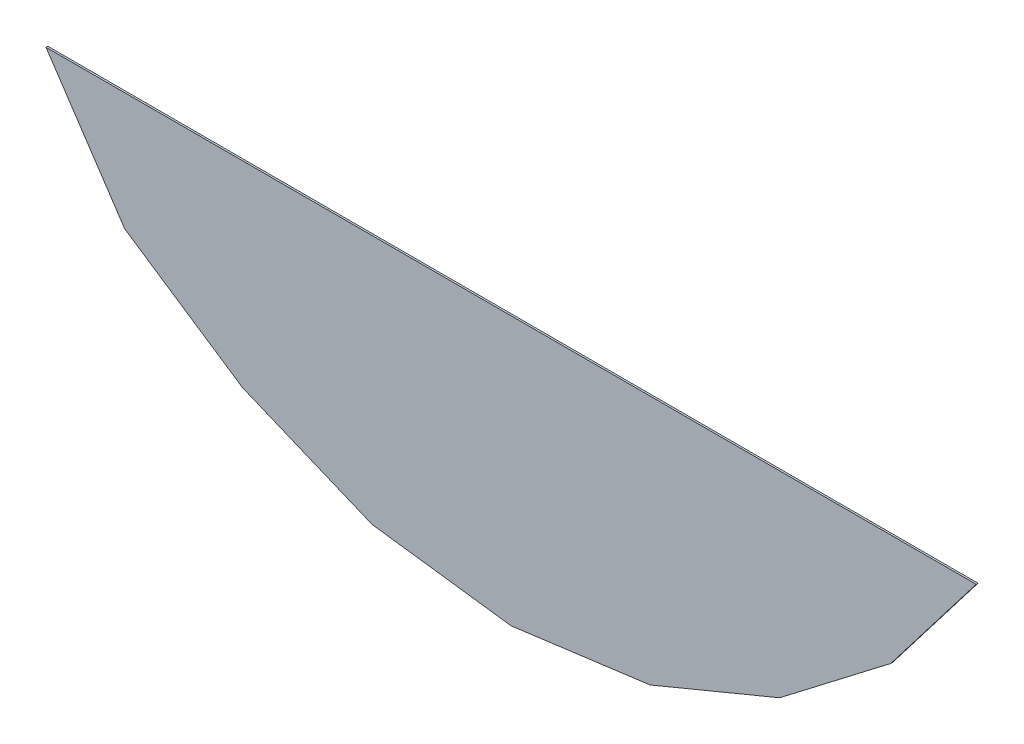
ISO-10303-21;
HEADER;
FILE_DESCRIPTION(('STEP AP214'),'2;1');
FILE_NAME('part.step','',(''),(''),'','','');
FILE_SCHEMA(('AUTOMOTIVE_DESIGN { 1 0 10303 214 1 1 1 1 }'));
ENDSEC;
DATA;
#1=APPLICATION_CONTEXT('core data for automotive mechanical design processes');
#2=APPLICATION_PROTOCOL_DEFINITION('international standard','automotive_design',2000,#1);
#3=PRODUCT_CONTEXT('',#1,'mechanical');
#4=PRODUCT('Part','Part','',(#3));
#5=PRODUCT_RELATED_PRODUCT_CATEGORY('part','',(#4));
#6=PRODUCT_DEFINITION_FORMATION('','',#4);
#7=PRODUCT_DEFINITION_CONTEXT('part definition',#1,'design');
#8=PRODUCT_DEFINITION('design','',#6,#7);
#9=PRODUCT_DEFINITION_SHAPE('','',#8);
#10=(LENGTH_UNIT() NAMED_UNIT(*) SI_UNIT(.MILLI.,.METRE.));
#11=(NAMED_UNIT(*) PLANE_ANGLE_UNIT() SI_UNIT($,.RADIAN.));
#12=(NAMED_UNIT(*) SI_UNIT($,.STERADIAN.) SOLID_ANGLE_UNIT());
#13=UNCERTAINTY_MEASURE_WITH_UNIT(LENGTH_MEASURE(1.E-05),#10,'distance_accuracy_value','');
#14=(GEOMETRIC_REPRESENTATION_CONTEXT(3) GLOBAL_UNCERTAINTY_ASSIGNED_CONTEXT((#13)) GLOBAL_UNIT_ASSIGNED_CONTEXT((#10,
#11,#12)) REPRESENTATION_CONTEXT('',''));
#15=CARTESIAN_POINT('',(0.,0.,0.));
#16=DIRECTION('',(0.,0.,1.));
#17=DIRECTION('',(1.,0.,0.));
#18=AXIS2_PLACEMENT_3D('',#15,#16,#17);
#19=CARTESIAN_POINT('',(-2.55477772,-4.28920148,3.9099998));
#20=DIRECTION('',(0.,0.,1.));
#21=DIRECTION('',(1.,0.,0.));
#22=AXIS2_PLACEMENT_3D('',#19,#20,#21);
#23=PLANE('',#22);
#24=DIRECTION('',(0.923879753352727,0.382682899206254,0.));
#25=VECTOR('',#24,1.);
#26=CARTESIAN_POINT('',(0.763513839999964,-5.66368183999992,3.9099998));
#27=LINE('',#26,#25);
#28=CARTESIAN_POINT('',(0.763513839999941,-5.66368183999987,3.9099998));
#29=VERTEX_POINT('',#28);
#30=CARTESIAN_POINT('',(1.47499832000001,-5.36897580000002,3.9099998));
#31=VERTEX_POINT('',#30);
#32=EDGE_CURVE('E91',#29,#31,#27,.T.);
#33=ORIENTED_EDGE('',*,*,#32,.T.);
#34=DIRECTION('',(0.793354187267818,0.608760325205758,0.));
#35=VECTOR('',#34,1.);
#36=CARTESIAN_POINT('',(1.47499832000001,-5.36897580000001,3.9099998));
#37=LINE('',#36,#35);
#38=CARTESIAN_POINT('',(2.08596230000003,-4.90016800000002,3.9099998));
#39=VERTEX_POINT('',#38);
#40=EDGE_CURVE('E88',#31,#39,#37,.T.);
#41=ORIENTED_EDGE('',*,*,#40,.T.);
#42=DIRECTION('',(0.608760808228389,0.793353816632351,0.));
#43=VECTOR('',#42,1.);
#44=CARTESIAN_POINT('',(2.08596230000002,-4.90016800000001,3.9099998));
#45=LINE('',#44,#43);
#46=CARTESIAN_POINT('',(2.55477264,-4.28920148,3.9099998));
#47=VERTEX_POINT('',#46);
#48=EDGE_CURVE('E20',#39,#47,#45,.T.);
#49=ORIENTED_EDGE('',*,*,#48,.T.);
#50=DIRECTION('',(1.,0.,0.));
#51=VECTOR('',#50,1.);
#52=CARTESIAN_POINT('',(-2.55477772,-4.28920148,3.9099998));
#53=LINE('',#52,#51);
#54=CARTESIAN_POINT('',(-2.5547777200001,-4.28920148000002,3.9099998));
#55=VERTEX_POINT('',#54);
#56=EDGE_CURVE('E94',#55,#47,#53,.T.);
#57=ORIENTED_EDGE('',*,*,#56,.F.);
#58=DIRECTION('',(0.555139797690147,-0.831757058894328,0.));
#59=VECTOR('',#58,1.);
#60=CARTESIAN_POINT('',(-2.55477772000007,-4.28920148000005,3.9099998));
#61=LINE('',#60,#59);
#62=CARTESIAN_POINT('',(-2.12257131999997,-4.93676939999994,3.9099998));
#63=VERTEX_POINT('',#62);
#64=EDGE_CURVE('E84',#55,#63,#61,.T.);
#65=ORIENTED_EDGE('',*,*,#64,.T.);
#66=DIRECTION('',(0.831757058894323,-0.555139797690155,0.));
#67=VECTOR('',#66,1.);
#68=CARTESIAN_POINT('',(-2.12257131999998,-4.93676939999997,3.9099998));
#69=LINE('',#68,#67);
#70=CARTESIAN_POINT('',(-1.47500340000005,-5.36897580000013,3.9099998));
#71=VERTEX_POINT('',#70);
#72=EDGE_CURVE('E105',#63,#71,#69,.T.);
#73=ORIENTED_EDGE('',*,*,#72,.T.);
#74=DIRECTION('',(0.92387975335268,-0.382682899206369,0.));
#75=VECTOR('',#74,1.);
#76=CARTESIAN_POINT('',(-1.47500340000004,-5.36897580000008,3.9099998));
#77=LINE('',#76,#75);
#78=CARTESIAN_POINT('',(-0.763518920000012,-5.66368184000013,3.9099998));
#79=VERTEX_POINT('',#78);
#80=EDGE_CURVE('E106',#71,#79,#77,.T.);
#81=ORIENTED_EDGE('',*,*,#80,.T.);
#82=DIRECTION('',(0.991445008976792,-0.130525071059199,0.));
#83=VECTOR('',#82,1.);
#84=CARTESIAN_POINT('',(-0.763518920000012,-5.66368184000008,3.9099998));
#85=LINE('',#84,#83);
#86=CARTESIAN_POINT('',(-2.54000002067E-06,-5.76419979999987,3.9099998));
#87=VERTEX_POINT('',#86);
#88=EDGE_CURVE('E110',#79,#87,#85,.T.);
#89=ORIENTED_EDGE('',*,*,#88,.T.);
#90=DIRECTION('',(0.991445008976763,0.130525071059419,0.));
#91=VECTOR('',#90,1.);
#92=CARTESIAN_POINT('',(-2.54000000806526E-06,-5.76419979999992,3.9099998));
#93=LINE('',#92,#91);
#94=EDGE_CURVE('E112',#87,#29,#93,.T.);
#95=ORIENTED_EDGE('',*,*,#94,.T.);
#96=EDGE_LOOP('',(#33,#41,#49,#57,#65,#73,#81,#89,#95));
#97=FACE_BOUND('',#96,.T.);
#98=ADVANCED_FACE('F17',(#97),#23,.T.);
#99=CARTESIAN_POINT('',(-2.55477772,-4.28920148,3.89999982));
#100=DIRECTION('',(0.,1.,0.));
#101=DIRECTION('',(0.,0.,1.));
#102=AXIS2_PLACEMENT_3D('',#99,#100,#101);
#103=PLANE('',#102);
#104=DIRECTION('',(0.,0.,1.));
#105=VECTOR('',#104,1.);
#106=CARTESIAN_POINT('',(-2.55477772000014,-4.2892014800001,3.89999982));
#107=LINE('',#106,#105);
#108=CARTESIAN_POINT('',(-2.5547777200001,-4.28920148000002,3.89999982));
#109=VERTEX_POINT('',#108);
#110=EDGE_CURVE('E116',#55,#109,#107,.F.);
#111=ORIENTED_EDGE('',*,*,#110,.F.);
#112=ORIENTED_EDGE('',*,*,#56,.T.);
#113=DIRECTION('',(0.,0.,1.));
#114=VECTOR('',#113,1.);
#115=CARTESIAN_POINT('',(2.55477264,-4.28920148,3.89999982));
#116=LINE('',#115,#114);
#117=CARTESIAN_POINT('',(2.55477264,-4.28920148,3.89999982));
#118=VERTEX_POINT('',#117);
#119=EDGE_CURVE('E99',#118,#47,#116,.T.);
#120=ORIENTED_EDGE('',*,*,#119,.F.);
#121=DIRECTION('',(1.,0.,0.));
#122=VECTOR('',#121,1.);
#123=CARTESIAN_POINT('',(-2.55477772,-4.28920148,3.89999982));
#124=LINE('',#123,#122);
#125=EDGE_CURVE('E130',#118,#109,#124,.F.);
#126=ORIENTED_EDGE('',*,*,#125,.T.);
#127=EDGE_LOOP('',(#111,#112,#120,#126));
#128=FACE_BOUND('',#127,.T.);
#129=ADVANCED_FACE('F181',(#128),#103,.T.);
#130=CARTESIAN_POINT('',(-2.12257132,-4.9367694,3.89999982));
#131=DIRECTION('',(-0.831757058894295,-0.555139797690197,0.));
#132=DIRECTION('',(0.555139797690197,-0.831757058894295,0.));
#133=AXIS2_PLACEMENT_3D('',#130,#131,#132);
#134=PLANE('',#133);
#135=DIRECTION('',(0.,0.,1.));
#136=VECTOR('',#135,1.);
#137=CARTESIAN_POINT('',(-2.12257131999991,-4.93676939999986,3.89999982));
#138=LINE('',#137,#136);
#139=CARTESIAN_POINT('',(-2.12257131999998,-4.93676939999995,3.89999982));
#140=VERTEX_POINT('',#139);
#141=EDGE_CURVE('E118',#63,#140,#138,.F.);
#142=ORIENTED_EDGE('',*,*,#141,.F.);
#143=ORIENTED_EDGE('',*,*,#64,.F.);
#144=ORIENTED_EDGE('',*,*,#110,.T.);
#145=DIRECTION('',(0.555139797690147,-0.831757058894328,0.));
#146=VECTOR('',#145,1.);
#147=CARTESIAN_POINT('',(-2.55477772000007,-4.28920148000005,3.89999982));
#148=LINE('',#147,#146);
#149=EDGE_CURVE('E133',#109,#140,#148,.T.);
#150=ORIENTED_EDGE('',*,*,#149,.T.);
#151=EDGE_LOOP('',(#142,#143,#144,#150));
#152=FACE_BOUND('',#151,.T.);
#153=ADVANCED_FACE('F178',(#152),#134,.T.);
#154=CARTESIAN_POINT('',(-1.4750034,-5.3689758,3.89999982));
#155=DIRECTION('',(-0.555139797690197,-0.831757058894295,0.));
#156=DIRECTION('',(0.831757058894295,-0.555139797690197,0.));
#157=AXIS2_PLACEMENT_3D('',#154,#155,#156);
#158=PLANE('',#157);
#159=DIRECTION('',(0.,0.,1.));
#160=VECTOR('',#159,1.);
#161=CARTESIAN_POINT('',(-1.47500340000014,-5.36897580000034,3.89999982));
#162=LINE('',#161,#160);
#163=CARTESIAN_POINT('',(-1.47500340000004,-5.36897580000011,3.89999982));
#164=VERTEX_POINT('',#163);
#165=EDGE_CURVE('E120',#71,#164,#162,.F.);
#166=ORIENTED_EDGE('',*,*,#165,.F.);
#167=ORIENTED_EDGE('',*,*,#72,.F.);
#168=ORIENTED_EDGE('',*,*,#141,.T.);
#169=DIRECTION('',(0.831757058894323,-0.555139797690155,0.));
#170=VECTOR('',#169,1.);
#171=CARTESIAN_POINT('',(-2.12257131999998,-4.93676939999997,3.89999982));
#172=LINE('',#171,#170);
#173=EDGE_CURVE('E136',#140,#164,#172,.T.);
#174=ORIENTED_EDGE('',*,*,#173,.T.);
#175=EDGE_LOOP('',(#166,#167,#168,#174));
#176=FACE_BOUND('',#175,.T.);
#177=ADVANCED_FACE('F175',(#176),#158,.T.);
#178=CARTESIAN_POINT('',(-0.76351892,-5.66368184,3.89999982));
#179=DIRECTION('',(-0.382682899205941,-0.923879753352857,0.));
#180=DIRECTION('',(0.923879753352857,-0.382682899205941,0.));
#181=AXIS2_PLACEMENT_3D('',#178,#179,#180);
#182=PLANE('',#181);
#183=DIRECTION('',(0.,0.,1.));
#184=VECTOR('',#183,1.);
#185=CARTESIAN_POINT('',(-0.763518920000046,-5.66368184000034,3.89999982));
#186=LINE('',#185,#184);
#187=CARTESIAN_POINT('',(-0.763518920000005,-5.66368184000011,3.89999982));
#188=VERTEX_POINT('',#187);
#189=EDGE_CURVE('E122',#79,#188,#186,.F.);
#190=ORIENTED_EDGE('',*,*,#189,.F.);
#191=ORIENTED_EDGE('',*,*,#80,.F.);
#192=ORIENTED_EDGE('',*,*,#165,.T.);
#193=DIRECTION('',(0.92387975335268,-0.382682899206368,0.));
#194=VECTOR('',#193,1.);
#195=CARTESIAN_POINT('',(-1.47500340000004,-5.36897580000008,3.89999982));
#196=LINE('',#195,#194);
#197=EDGE_CURVE('E139',#164,#188,#196,.T.);
#198=ORIENTED_EDGE('',*,*,#197,.T.);
#199=EDGE_LOOP('',(#190,#191,#192,#198));
#200=FACE_BOUND('',#199,.T.);
#201=ADVANCED_FACE('F170',(#200),#182,.T.);
#202=CARTESIAN_POINT('',(-2.539999996998E-06,-5.7641998,3.89999982));
#203=DIRECTION('',(-0.130525071058976,-0.991445008976821,0.));
#204=DIRECTION('',(0.991445008976821,-0.130525071058976,0.));
#205=AXIS2_PLACEMENT_3D('',#202,#203,#204);
#206=PLANE('',#205);
#207=DIRECTION('',(0.,0.,1.));
#208=VECTOR('',#207,1.);
#209=CARTESIAN_POINT('',(-2.54000004167552E-06,-5.76419979999966,3.89999982));
#210=LINE('',#209,#208);
#211=CARTESIAN_POINT('',(-2.54000002262806E-06,-5.76419979999989,3.89999982));
#212=VERTEX_POINT('',#211);
#213=EDGE_CURVE('E124',#87,#212,#210,.F.);
#214=ORIENTED_EDGE('',*,*,#213,.F.);
#215=ORIENTED_EDGE('',*,*,#88,.F.);
#216=ORIENTED_EDGE('',*,*,#189,.T.);
#217=DIRECTION('',(0.991445008976792,-0.130525071059199,0.));
#218=VECTOR('',#217,1.);
#219=CARTESIAN_POINT('',(-0.763518920000012,-5.66368184000008,3.89999982));
#220=LINE('',#219,#218);
#221=EDGE_CURVE('E142',#188,#212,#220,.T.);
#222=ORIENTED_EDGE('',*,*,#221,.T.);
#223=EDGE_LOOP('',(#214,#215,#216,#222));
#224=FACE_BOUND('',#223,.T.);
#225=ADVANCED_FACE('F165',(#224),#206,.T.);
#226=CARTESIAN_POINT('',(0.76351384,-5.66368184,3.89999982));
#227=DIRECTION('',(0.130525071058976,-0.991445008976821,0.));
#228=DIRECTION('',(0.991445008976821,0.130525071058976,0.));
#229=AXIS2_PLACEMENT_3D('',#226,#227,#228);
#230=PLANE('',#229);
#231=DIRECTION('',(0.,0.,1.));
#232=VECTOR('',#231,1.);
#233=CARTESIAN_POINT('',(0.763513839999859,-5.66368183999966,3.89999982));
#234=LINE('',#233,#232);
#235=CARTESIAN_POINT('',(0.763513839999943,-5.6636818399999,3.89999982));
#236=VERTEX_POINT('',#235);
#237=EDGE_CURVE('E126',#29,#236,#234,.F.);
#238=ORIENTED_EDGE('',*,*,#237,.F.);
#239=ORIENTED_EDGE('',*,*,#94,.F.);
#240=ORIENTED_EDGE('',*,*,#213,.T.);
#241=DIRECTION('',(0.991445008976763,0.130525071059419,0.));
#242=VECTOR('',#241,1.);
#243=CARTESIAN_POINT('',(-2.54000000806526E-06,-5.76419979999992,3.89999982));
#244=LINE('',#243,#242);
#245=EDGE_CURVE('E145',#212,#236,#244,.T.);
#246=ORIENTED_EDGE('',*,*,#245,.T.);
#247=EDGE_LOOP('',(#238,#239,#240,#246));
#248=FACE_BOUND('',#247,.T.);
#249=ADVANCED_FACE('F160',(#248),#230,.T.);
#250=CARTESIAN_POINT('',(1.47499832,-5.3689758,3.89999982));
#251=DIRECTION('',(0.382682899205941,-0.923879753352857,0.));
#252=DIRECTION('',(0.923879753352857,0.382682899205941,0.));
#253=AXIS2_PLACEMENT_3D('',#250,#251,#252);
#254=PLANE('',#253);
#255=DIRECTION('',(0.,0.,1.));
#256=VECTOR('',#255,1.);
#257=CARTESIAN_POINT('',(1.47499832000003,-5.36897580000004,3.89999982));
#258=LINE('',#257,#256);
#259=CARTESIAN_POINT('',(1.47499832000001,-5.36897580000001,3.89999982));
#260=VERTEX_POINT('',#259);
#261=EDGE_CURVE('E100',#31,#260,#258,.F.);
#262=ORIENTED_EDGE('',*,*,#261,.F.);
#263=ORIENTED_EDGE('',*,*,#32,.F.);
#264=ORIENTED_EDGE('',*,*,#237,.T.);
#265=DIRECTION('',(0.923879753352727,0.382682899206254,0.));
#266=VECTOR('',#265,1.);
#267=CARTESIAN_POINT('',(0.763513839999964,-5.66368183999992,3.89999982));
#268=LINE('',#267,#266);
#269=EDGE_CURVE('E148',#236,#260,#268,.T.);
#270=ORIENTED_EDGE('',*,*,#269,.T.);
#271=EDGE_LOOP('',(#262,#263,#264,#270));
#272=FACE_BOUND('',#271,.T.);
#273=ADVANCED_FACE('F153',(#272),#254,.T.);
#274=CARTESIAN_POINT('',(2.0859623,-4.900168,3.89999982));
#275=DIRECTION('',(0.608760325205822,-0.793354187267769,0.));
#276=DIRECTION('',(0.793354187267769,0.608760325205822,0.));
#277=AXIS2_PLACEMENT_3D('',#274,#275,#276);
#278=PLANE('',#277);
#279=DIRECTION('',(0.,0.,1.));
#280=VECTOR('',#279,1.);
#281=CARTESIAN_POINT('',(2.08596230000008,-4.90016800000006,3.89999982));
#282=LINE('',#281,#280);
#283=CARTESIAN_POINT('',(2.08596230000003,-4.90016800000002,3.89999982));
#284=VERTEX_POINT('',#283);
#285=EDGE_CURVE('E34',#39,#284,#282,.F.);
#286=ORIENTED_EDGE('',*,*,#285,.F.);
#287=ORIENTED_EDGE('',*,*,#40,.F.);
#288=ORIENTED_EDGE('',*,*,#261,.T.);
#289=DIRECTION('',(0.793354187267818,0.608760325205758,0.));
#290=VECTOR('',#289,1.);
#291=CARTESIAN_POINT('',(1.47499832000001,-5.36897580000001,3.89999982));
#292=LINE('',#291,#290);
#293=EDGE_CURVE('E26',#260,#284,#292,.T.);
#294=ORIENTED_EDGE('',*,*,#293,.T.);
#295=EDGE_LOOP('',(#286,#287,#288,#294));
#296=FACE_BOUND('',#295,.T.);
#297=ADVANCED_FACE('F97',(#296),#278,.T.);
#298=CARTESIAN_POINT('',(2.55477264,-4.28920148,3.89999982));
#299=DIRECTION('',(0.793353816632409,-0.608760808228314,0.));
#300=DIRECTION('',(0.608760808228314,0.793353816632409,0.));
#301=AXIS2_PLACEMENT_3D('',#298,#299,#300);
#302=PLANE('',#301);
#303=ORIENTED_EDGE('',*,*,#119,.T.);
#304=ORIENTED_EDGE('',*,*,#48,.F.);
#305=ORIENTED_EDGE('',*,*,#285,.T.);
#306=DIRECTION('',(0.608760808228389,0.793353816632351,0.));
#307=VECTOR('',#306,1.);
#308=CARTESIAN_POINT('',(2.08596230000002,-4.90016800000001,3.89999982));
#309=LINE('',#308,#307);
#310=EDGE_CURVE('E11',#284,#118,#309,.T.);
#311=ORIENTED_EDGE('',*,*,#310,.T.);
#312=EDGE_LOOP('',(#303,#304,#305,#311));
#313=FACE_BOUND('',#312,.T.);
#314=ADVANCED_FACE('F103',(#313),#302,.T.);
#315=CARTESIAN_POINT('',(-2.55477772,-4.28920148,3.89999982));
#316=DIRECTION('',(0.,0.,1.));
#317=DIRECTION('',(1.,0.,0.));
#318=AXIS2_PLACEMENT_3D('',#315,#316,#317);
#319=PLANE('',#318);
#320=ORIENTED_EDGE('',*,*,#293,.F.);
#321=ORIENTED_EDGE('',*,*,#269,.F.);
#322=ORIENTED_EDGE('',*,*,#245,.F.);
#323=ORIENTED_EDGE('',*,*,#221,.F.);
#324=ORIENTED_EDGE('',*,*,#197,.F.);
#325=ORIENTED_EDGE('',*,*,#173,.F.);
#326=ORIENTED_EDGE('',*,*,#149,.F.);
#327=ORIENTED_EDGE('',*,*,#125,.F.);
#328=ORIENTED_EDGE('',*,*,#310,.F.);
#329=EDGE_LOOP('',(#320,#321,#322,#323,#324,#325,#326,#327,#328));
#330=FACE_BOUND('',#329,.T.);
#331=ADVANCED_FACE('F157',(#330),#319,.F.);
#332=CLOSED_SHELL('',(#98,#129,#153,#177,#201,#225,#249,#273,#297,#314,#331));
#333=MANIFOLD_SOLID_BREP('B1',#332);
#334=ADVANCED_BREP_SHAPE_REPRESENTATION('',(#18,#333),#14);
#335=SHAPE_DEFINITION_REPRESENTATION(#9,#334);
ENDSEC;
END-ISO-10303-21;
